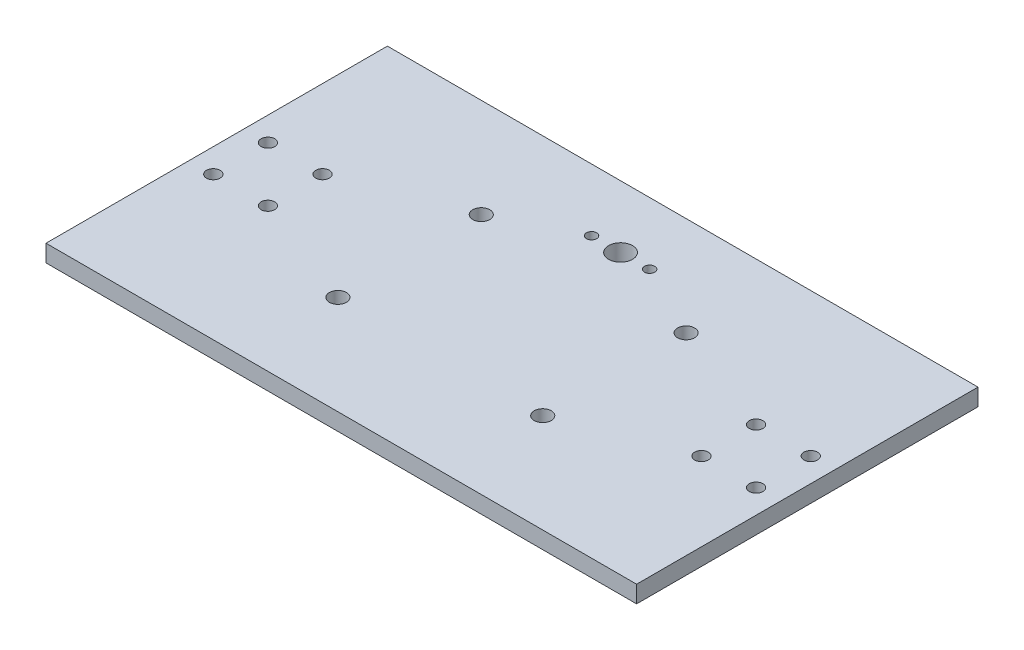
ISO-10303-21;
HEADER;
FILE_DESCRIPTION(('STEP AP214'),'2;1');
FILE_NAME('part.step','',(''),(''),'','','');
FILE_SCHEMA(('AUTOMOTIVE_DESIGN { 1 0 10303 214 1 1 1 1 }'));
ENDSEC;
DATA;
#1=APPLICATION_CONTEXT('core data for automotive mechanical design processes');
#2=APPLICATION_PROTOCOL_DEFINITION('international standard','automotive_design',2000,#1);
#3=PRODUCT_CONTEXT('',#1,'mechanical');
#4=PRODUCT('Part','Part','',(#3));
#5=PRODUCT_RELATED_PRODUCT_CATEGORY('part','',(#4));
#6=PRODUCT_DEFINITION_FORMATION('','',#4);
#7=PRODUCT_DEFINITION_CONTEXT('part definition',#1,'design');
#8=PRODUCT_DEFINITION('design','',#6,#7);
#9=PRODUCT_DEFINITION_SHAPE('','',#8);
#10=(LENGTH_UNIT() NAMED_UNIT(*) SI_UNIT(.MILLI.,.METRE.));
#11=(NAMED_UNIT(*) PLANE_ANGLE_UNIT() SI_UNIT($,.RADIAN.));
#12=(NAMED_UNIT(*) SI_UNIT($,.STERADIAN.) SOLID_ANGLE_UNIT());
#13=UNCERTAINTY_MEASURE_WITH_UNIT(LENGTH_MEASURE(1.E-05),#10,'distance_accuracy_value','');
#14=(GEOMETRIC_REPRESENTATION_CONTEXT(3) GLOBAL_UNCERTAINTY_ASSIGNED_CONTEXT((#13)) GLOBAL_UNIT_ASSIGNED_CONTEXT((#10,
#11,#12)) REPRESENTATION_CONTEXT('',''));
#15=CARTESIAN_POINT('',(0.,0.,0.));
#16=DIRECTION('',(0.,0.,1.));
#17=DIRECTION('',(1.,0.,0.));
#18=AXIS2_PLACEMENT_3D('',#15,#16,#17);
#19=CARTESIAN_POINT('',(0.,5.,0.));
#20=DIRECTION('',(0.,1.,0.));
#21=DIRECTION('',(0.,0.,1.));
#22=AXIS2_PLACEMENT_3D('',#19,#20,#21);
#23=PLANE('',#22);
#24=CARTESIAN_POINT('',(-79.5,5.,23.8));
#25=DIRECTION('',(0.,1.,0.));
#26=DIRECTION('',(0.,0.,-1.));
#27=AXIS2_PLACEMENT_3D('',#24,#25,#26);
#28=CIRCLE('',#27,2.);
#29=CARTESIAN_POINT('',(-79.5,5.,21.8));
#30=VERTEX_POINT('',#29);
#31=EDGE_CURVE('E187',#30,#30,#28,.T.);
#32=ORIENTED_EDGE('',*,*,#31,.F.);
#33=EDGE_LOOP('',(#32));
#34=FACE_BOUND('',#33,.T.);
#35=CARTESIAN_POINT('',(-63.5,5.,39.8));
#36=DIRECTION('',(0.,1.,0.));
#37=DIRECTION('',(0.,0.,-1.));
#38=AXIS2_PLACEMENT_3D('',#35,#36,#37);
#39=CIRCLE('',#38,2.);
#40=CARTESIAN_POINT('',(-63.5,5.,37.8));
#41=VERTEX_POINT('',#40);
#42=EDGE_CURVE('E175',#41,#41,#39,.T.);
#43=ORIENTED_EDGE('',*,*,#42,.F.);
#44=EDGE_LOOP('',(#43));
#45=FACE_BOUND('',#44,.T.);
#46=CARTESIAN_POINT('',(79.5,5.,39.8));
#47=DIRECTION('',(0.,1.,0.));
#48=DIRECTION('',(0.,0.,1.));
#49=AXIS2_PLACEMENT_3D('',#46,#47,#48);
#50=CIRCLE('',#49,2.);
#51=CARTESIAN_POINT('',(79.5,5.,41.8));
#52=VERTEX_POINT('',#51);
#53=EDGE_CURVE('E163',#52,#52,#50,.T.);
#54=ORIENTED_EDGE('',*,*,#53,.F.);
#55=EDGE_LOOP('',(#54));
#56=FACE_BOUND('',#55,.T.);
#57=CARTESIAN_POINT('',(63.5,5.,23.8));
#58=DIRECTION('',(0.,1.,0.));
#59=DIRECTION('',(0.,0.,1.));
#60=AXIS2_PLACEMENT_3D('',#57,#58,#59);
#61=CIRCLE('',#60,1.99999999999998);
#62=CARTESIAN_POINT('',(63.5,5.,25.8));
#63=VERTEX_POINT('',#62);
#64=EDGE_CURVE('E151',#63,#63,#61,.T.);
#65=ORIENTED_EDGE('',*,*,#64,.F.);
#66=EDGE_LOOP('',(#65));
#67=FACE_BOUND('',#66,.T.);
#68=CARTESIAN_POINT('',(30.,5.,52.7999999999999));
#69=DIRECTION('',(0.,1.,0.));
#70=DIRECTION('',(0.,0.,-1.));
#71=AXIS2_PLACEMENT_3D('',#68,#69,#70);
#72=CIRCLE('',#71,2.5);
#73=CARTESIAN_POINT('',(30.,5.,50.2999999999999));
#74=VERTEX_POINT('',#73);
#75=EDGE_CURVE('E139',#74,#74,#72,.T.);
#76=ORIENTED_EDGE('',*,*,#75,.F.);
#77=EDGE_LOOP('',(#76));
#78=FACE_BOUND('',#77,.T.);
#79=CARTESIAN_POINT('',(-30.,5.,10.8));
#80=DIRECTION('',(0.,1.,0.));
#81=DIRECTION('',(0.,0.,1.));
#82=AXIS2_PLACEMENT_3D('',#79,#80,#81);
#83=CIRCLE('',#82,2.49999999999999);
#84=CARTESIAN_POINT('',(-30.,5.,13.3));
#85=VERTEX_POINT('',#84);
#86=EDGE_CURVE('E127',#85,#85,#83,.T.);
#87=ORIENTED_EDGE('',*,*,#86,.F.);
#88=EDGE_LOOP('',(#87));
#89=FACE_BOUND('',#88,.T.);
#90=CARTESIAN_POINT('',(-8.5,5.,0.));
#91=DIRECTION('',(0.,1.,0.));
#92=DIRECTION('',(0.,0.,1.));
#93=AXIS2_PLACEMENT_3D('',#90,#91,#92);
#94=CIRCLE('',#93,1.5);
#95=CARTESIAN_POINT('',(-8.5,5.,1.5));
#96=VERTEX_POINT('',#95);
#97=EDGE_CURVE('E115',#96,#96,#94,.T.);
#98=ORIENTED_EDGE('',*,*,#97,.F.);
#99=EDGE_LOOP('',(#98));
#100=FACE_BOUND('',#99,.T.);
#101=DIRECTION('',(0.,0.,1.));
#102=VECTOR('',#101,1.);
#103=CARTESIAN_POINT('',(-86.5,5.,-18.2));
#104=LINE('',#103,#102);
#105=CARTESIAN_POINT('',(-86.5,5.,-18.2));
#106=VERTEX_POINT('',#105);
#107=CARTESIAN_POINT('',(-86.5,5.,81.8));
#108=VERTEX_POINT('',#107);
#109=EDGE_CURVE('E85',#106,#108,#104,.T.);
#110=ORIENTED_EDGE('',*,*,#109,.T.);
#111=DIRECTION('',(1.,0.,0.));
#112=VECTOR('',#111,1.);
#113=CARTESIAN_POINT('',(-86.5,5.,81.8));
#114=LINE('',#113,#112);
#115=CARTESIAN_POINT('',(86.5,5.,81.8));
#116=VERTEX_POINT('',#115);
#117=EDGE_CURVE('E80',#108,#116,#114,.T.);
#118=ORIENTED_EDGE('',*,*,#117,.T.);
#119=DIRECTION('',(0.,0.,-1.));
#120=VECTOR('',#119,1.);
#121=CARTESIAN_POINT('',(86.5,5.,-18.2));
#122=LINE('',#121,#120);
#123=CARTESIAN_POINT('',(86.5,5.,-18.2));
#124=VERTEX_POINT('',#123);
#125=EDGE_CURVE('E83',#116,#124,#122,.T.);
#126=ORIENTED_EDGE('',*,*,#125,.T.);
#127=DIRECTION('',(-1.,0.,0.));
#128=VECTOR('',#127,1.);
#129=CARTESIAN_POINT('',(-86.5,5.,-18.2));
#130=LINE('',#129,#128);
#131=EDGE_CURVE('E50',#124,#106,#130,.T.);
#132=ORIENTED_EDGE('',*,*,#131,.T.);
#133=EDGE_LOOP('',(#110,#118,#126,#132));
#134=FACE_BOUND('',#133,.T.);
#135=CARTESIAN_POINT('',(0.,5.,0.));
#136=DIRECTION('',(0.,1.,0.));
#137=DIRECTION('',(0.,0.,1.));
#138=AXIS2_PLACEMENT_3D('',#135,#136,#137);
#139=CIRCLE('',#138,3.5);
#140=CARTESIAN_POINT('',(0.,5.,3.5));
#141=VERTEX_POINT('',#140);
#142=EDGE_CURVE('E100',#141,#141,#139,.T.);
#143=ORIENTED_EDGE('',*,*,#142,.F.);
#144=EDGE_LOOP('',(#143));
#145=FACE_BOUND('',#144,.T.);
#146=CARTESIAN_POINT('',(8.5,5.,0.));
#147=DIRECTION('',(0.,1.,0.));
#148=DIRECTION('',(0.,0.,1.));
#149=AXIS2_PLACEMENT_3D('',#146,#147,#148);
#150=CIRCLE('',#149,1.5);
#151=CARTESIAN_POINT('',(8.5,5.,1.50000000000006));
#152=VERTEX_POINT('',#151);
#153=EDGE_CURVE('E121',#152,#152,#150,.T.);
#154=ORIENTED_EDGE('',*,*,#153,.F.);
#155=EDGE_LOOP('',(#154));
#156=FACE_BOUND('',#155,.T.);
#157=CARTESIAN_POINT('',(-30.0000000000001,5.,52.8));
#158=DIRECTION('',(0.,1.,0.));
#159=DIRECTION('',(0.,0.,1.));
#160=AXIS2_PLACEMENT_3D('',#157,#158,#159);
#161=CIRCLE('',#160,2.50000000000008);
#162=CARTESIAN_POINT('',(-30.0000000000001,5.,55.3000000000001));
#163=VERTEX_POINT('',#162);
#164=EDGE_CURVE('E133',#163,#163,#161,.T.);
#165=ORIENTED_EDGE('',*,*,#164,.F.);
#166=EDGE_LOOP('',(#165));
#167=FACE_BOUND('',#166,.T.);
#168=CARTESIAN_POINT('',(30.,5.,10.8));
#169=DIRECTION('',(0.,1.,0.));
#170=DIRECTION('',(0.,0.,-1.));
#171=AXIS2_PLACEMENT_3D('',#168,#169,#170);
#172=CIRCLE('',#171,2.5);
#173=CARTESIAN_POINT('',(30.,5.,8.29999999999997));
#174=VERTEX_POINT('',#173);
#175=EDGE_CURVE('E145',#174,#174,#172,.T.);
#176=ORIENTED_EDGE('',*,*,#175,.F.);
#177=EDGE_LOOP('',(#176));
#178=FACE_BOUND('',#177,.T.);
#179=CARTESIAN_POINT('',(79.5,5.,23.8));
#180=DIRECTION('',(0.,1.,0.));
#181=DIRECTION('',(0.,0.,1.));
#182=AXIS2_PLACEMENT_3D('',#179,#180,#181);
#183=CIRCLE('',#182,2.);
#184=CARTESIAN_POINT('',(79.5,5.,25.8));
#185=VERTEX_POINT('',#184);
#186=EDGE_CURVE('E157',#185,#185,#183,.T.);
#187=ORIENTED_EDGE('',*,*,#186,.F.);
#188=EDGE_LOOP('',(#187));
#189=FACE_BOUND('',#188,.T.);
#190=CARTESIAN_POINT('',(63.5,5.,39.8));
#191=DIRECTION('',(0.,1.,0.));
#192=DIRECTION('',(0.,0.,1.));
#193=AXIS2_PLACEMENT_3D('',#190,#191,#192);
#194=CIRCLE('',#193,2.);
#195=CARTESIAN_POINT('',(63.5,5.,41.8));
#196=VERTEX_POINT('',#195);
#197=EDGE_CURVE('E169',#196,#196,#194,.T.);
#198=ORIENTED_EDGE('',*,*,#197,.F.);
#199=EDGE_LOOP('',(#198));
#200=FACE_BOUND('',#199,.T.);
#201=CARTESIAN_POINT('',(-79.5,5.,39.8));
#202=DIRECTION('',(0.,1.,0.));
#203=DIRECTION('',(0.,0.,-1.));
#204=AXIS2_PLACEMENT_3D('',#201,#202,#203);
#205=CIRCLE('',#204,2.);
#206=CARTESIAN_POINT('',(-79.5,5.,37.8));
#207=VERTEX_POINT('',#206);
#208=EDGE_CURVE('E181',#207,#207,#205,.T.);
#209=ORIENTED_EDGE('',*,*,#208,.F.);
#210=EDGE_LOOP('',(#209));
#211=FACE_BOUND('',#210,.T.);
#212=CARTESIAN_POINT('',(-63.5,5.,23.8));
#213=DIRECTION('',(0.,1.,0.));
#214=DIRECTION('',(0.,0.,-1.));
#215=AXIS2_PLACEMENT_3D('',#212,#213,#214);
#216=CIRCLE('',#215,1.99999999999998);
#217=CARTESIAN_POINT('',(-63.5,5.,21.8));
#218=VERTEX_POINT('',#217);
#219=EDGE_CURVE('E193',#218,#218,#216,.T.);
#220=ORIENTED_EDGE('',*,*,#219,.F.);
#221=EDGE_LOOP('',(#220));
#222=FACE_BOUND('',#221,.T.);
#223=ADVANCED_FACE('F33',(#34,#45,#56,#67,#78,#89,#100,#134,#145,#156,#167,#178,#189,#200,#211,
#222),#23,.T.);
#224=CARTESIAN_POINT('',(0.,0.,0.));
#225=DIRECTION('',(0.,1.,0.));
#226=DIRECTION('',(0.,0.,1.));
#227=AXIS2_PLACEMENT_3D('',#224,#225,#226);
#228=PLANE('',#227);
#229=DIRECTION('',(0.,0.,1.));
#230=VECTOR('',#229,1.);
#231=CARTESIAN_POINT('',(-86.5,0.,-18.2));
#232=LINE('',#231,#230);
#233=CARTESIAN_POINT('',(-86.5,0.,-18.2));
#234=VERTEX_POINT('',#233);
#235=CARTESIAN_POINT('',(-86.5,0.,81.8));
#236=VERTEX_POINT('',#235);
#237=EDGE_CURVE('E97',#234,#236,#232,.T.);
#238=ORIENTED_EDGE('',*,*,#237,.F.);
#239=DIRECTION('',(-1.,0.,0.));
#240=VECTOR('',#239,1.);
#241=CARTESIAN_POINT('',(-86.5,0.,-18.2));
#242=LINE('',#241,#240);
#243=CARTESIAN_POINT('',(86.5,0.,-18.2));
#244=VERTEX_POINT('',#243);
#245=EDGE_CURVE('E73',#244,#234,#242,.T.);
#246=ORIENTED_EDGE('',*,*,#245,.F.);
#247=DIRECTION('',(0.,0.,-1.));
#248=VECTOR('',#247,1.);
#249=CARTESIAN_POINT('',(86.5,0.,-18.2));
#250=LINE('',#249,#248);
#251=CARTESIAN_POINT('',(86.5,0.,81.8));
#252=VERTEX_POINT('',#251);
#253=EDGE_CURVE('E67',#252,#244,#250,.T.);
#254=ORIENTED_EDGE('',*,*,#253,.F.);
#255=DIRECTION('',(1.,0.,0.));
#256=VECTOR('',#255,1.);
#257=CARTESIAN_POINT('',(-86.5,0.,81.8));
#258=LINE('',#257,#256);
#259=EDGE_CURVE('E89',#236,#252,#258,.T.);
#260=ORIENTED_EDGE('',*,*,#259,.F.);
#261=EDGE_LOOP('',(#238,#246,#254,#260));
#262=FACE_BOUND('',#261,.T.);
#263=CARTESIAN_POINT('',(0.,0.,0.));
#264=DIRECTION('',(0.,1.,0.));
#265=DIRECTION('',(0.,0.,1.));
#266=AXIS2_PLACEMENT_3D('',#263,#264,#265);
#267=CIRCLE('',#266,3.5);
#268=CARTESIAN_POINT('',(0.,0.,3.5));
#269=VERTEX_POINT('',#268);
#270=EDGE_CURVE('E112',#269,#269,#267,.T.);
#271=ORIENTED_EDGE('',*,*,#270,.T.);
#272=EDGE_LOOP('',(#271));
#273=FACE_BOUND('',#272,.T.);
#274=CARTESIAN_POINT('',(-8.5,0.,0.));
#275=DIRECTION('',(0.,1.,0.));
#276=DIRECTION('',(0.,0.,1.));
#277=AXIS2_PLACEMENT_3D('',#274,#275,#276);
#278=CIRCLE('',#277,1.5);
#279=CARTESIAN_POINT('',(-8.5,0.,1.5));
#280=VERTEX_POINT('',#279);
#281=EDGE_CURVE('E118',#280,#280,#278,.T.);
#282=ORIENTED_EDGE('',*,*,#281,.T.);
#283=EDGE_LOOP('',(#282));
#284=FACE_BOUND('',#283,.T.);
#285=CARTESIAN_POINT('',(8.5,0.,0.));
#286=DIRECTION('',(0.,1.,0.));
#287=DIRECTION('',(0.,0.,1.));
#288=AXIS2_PLACEMENT_3D('',#285,#286,#287);
#289=CIRCLE('',#288,1.5);
#290=CARTESIAN_POINT('',(8.5,0.,1.50000000000006));
#291=VERTEX_POINT('',#290);
#292=EDGE_CURVE('E124',#291,#291,#289,.T.);
#293=ORIENTED_EDGE('',*,*,#292,.T.);
#294=EDGE_LOOP('',(#293));
#295=FACE_BOUND('',#294,.T.);
#296=CARTESIAN_POINT('',(-30.,0.,10.8));
#297=DIRECTION('',(0.,1.,0.));
#298=DIRECTION('',(0.,0.,1.));
#299=AXIS2_PLACEMENT_3D('',#296,#297,#298);
#300=CIRCLE('',#299,2.49999999999999);
#301=CARTESIAN_POINT('',(-30.,0.,13.3));
#302=VERTEX_POINT('',#301);
#303=EDGE_CURVE('E130',#302,#302,#300,.T.);
#304=ORIENTED_EDGE('',*,*,#303,.T.);
#305=EDGE_LOOP('',(#304));
#306=FACE_BOUND('',#305,.T.);
#307=CARTESIAN_POINT('',(-30.0000000000001,0.,52.8));
#308=DIRECTION('',(0.,1.,0.));
#309=DIRECTION('',(0.,0.,1.));
#310=AXIS2_PLACEMENT_3D('',#307,#308,#309);
#311=CIRCLE('',#310,2.50000000000008);
#312=CARTESIAN_POINT('',(-30.0000000000001,0.,55.3000000000001));
#313=VERTEX_POINT('',#312);
#314=EDGE_CURVE('E136',#313,#313,#311,.T.);
#315=ORIENTED_EDGE('',*,*,#314,.T.);
#316=EDGE_LOOP('',(#315));
#317=FACE_BOUND('',#316,.T.);
#318=CARTESIAN_POINT('',(30.,0.,52.7999999999999));
#319=DIRECTION('',(0.,1.,0.));
#320=DIRECTION('',(0.,0.,-1.));
#321=AXIS2_PLACEMENT_3D('',#318,#319,#320);
#322=CIRCLE('',#321,2.5);
#323=CARTESIAN_POINT('',(30.,0.,50.2999999999999));
#324=VERTEX_POINT('',#323);
#325=EDGE_CURVE('E142',#324,#324,#322,.T.);
#326=ORIENTED_EDGE('',*,*,#325,.T.);
#327=EDGE_LOOP('',(#326));
#328=FACE_BOUND('',#327,.T.);
#329=CARTESIAN_POINT('',(30.,0.,10.8));
#330=DIRECTION('',(0.,1.,0.));
#331=DIRECTION('',(0.,0.,-1.));
#332=AXIS2_PLACEMENT_3D('',#329,#330,#331);
#333=CIRCLE('',#332,2.5);
#334=CARTESIAN_POINT('',(30.,0.,8.29999999999997));
#335=VERTEX_POINT('',#334);
#336=EDGE_CURVE('E148',#335,#335,#333,.T.);
#337=ORIENTED_EDGE('',*,*,#336,.T.);
#338=EDGE_LOOP('',(#337));
#339=FACE_BOUND('',#338,.T.);
#340=CARTESIAN_POINT('',(63.5,0.,23.8));
#341=DIRECTION('',(0.,1.,0.));
#342=DIRECTION('',(0.,0.,1.));
#343=AXIS2_PLACEMENT_3D('',#340,#341,#342);
#344=CIRCLE('',#343,1.99999999999998);
#345=CARTESIAN_POINT('',(63.5,0.,25.8));
#346=VERTEX_POINT('',#345);
#347=EDGE_CURVE('E154',#346,#346,#344,.T.);
#348=ORIENTED_EDGE('',*,*,#347,.T.);
#349=EDGE_LOOP('',(#348));
#350=FACE_BOUND('',#349,.T.);
#351=CARTESIAN_POINT('',(79.5,0.,23.8));
#352=DIRECTION('',(0.,1.,0.));
#353=DIRECTION('',(0.,0.,1.));
#354=AXIS2_PLACEMENT_3D('',#351,#352,#353);
#355=CIRCLE('',#354,2.);
#356=CARTESIAN_POINT('',(79.5,0.,25.8));
#357=VERTEX_POINT('',#356);
#358=EDGE_CURVE('E160',#357,#357,#355,.T.);
#359=ORIENTED_EDGE('',*,*,#358,.T.);
#360=EDGE_LOOP('',(#359));
#361=FACE_BOUND('',#360,.T.);
#362=CARTESIAN_POINT('',(79.5,0.,39.8));
#363=DIRECTION('',(0.,1.,0.));
#364=DIRECTION('',(0.,0.,1.));
#365=AXIS2_PLACEMENT_3D('',#362,#363,#364);
#366=CIRCLE('',#365,2.);
#367=CARTESIAN_POINT('',(79.5,0.,41.8));
#368=VERTEX_POINT('',#367);
#369=EDGE_CURVE('E166',#368,#368,#366,.T.);
#370=ORIENTED_EDGE('',*,*,#369,.T.);
#371=EDGE_LOOP('',(#370));
#372=FACE_BOUND('',#371,.T.);
#373=CARTESIAN_POINT('',(63.5,0.,39.8));
#374=DIRECTION('',(0.,1.,0.));
#375=DIRECTION('',(0.,0.,1.));
#376=AXIS2_PLACEMENT_3D('',#373,#374,#375);
#377=CIRCLE('',#376,2.);
#378=CARTESIAN_POINT('',(63.5,0.,41.8));
#379=VERTEX_POINT('',#378);
#380=EDGE_CURVE('E172',#379,#379,#377,.T.);
#381=ORIENTED_EDGE('',*,*,#380,.T.);
#382=EDGE_LOOP('',(#381));
#383=FACE_BOUND('',#382,.T.);
#384=CARTESIAN_POINT('',(-63.5,0.,39.8));
#385=DIRECTION('',(0.,1.,0.));
#386=DIRECTION('',(0.,0.,-1.));
#387=AXIS2_PLACEMENT_3D('',#384,#385,#386);
#388=CIRCLE('',#387,2.);
#389=CARTESIAN_POINT('',(-63.5,0.,37.8));
#390=VERTEX_POINT('',#389);
#391=EDGE_CURVE('E178',#390,#390,#388,.T.);
#392=ORIENTED_EDGE('',*,*,#391,.T.);
#393=EDGE_LOOP('',(#392));
#394=FACE_BOUND('',#393,.T.);
#395=CARTESIAN_POINT('',(-79.5,0.,39.8));
#396=DIRECTION('',(0.,1.,0.));
#397=DIRECTION('',(0.,0.,-1.));
#398=AXIS2_PLACEMENT_3D('',#395,#396,#397);
#399=CIRCLE('',#398,2.);
#400=CARTESIAN_POINT('',(-79.5,0.,37.8));
#401=VERTEX_POINT('',#400);
#402=EDGE_CURVE('E184',#401,#401,#399,.T.);
#403=ORIENTED_EDGE('',*,*,#402,.T.);
#404=EDGE_LOOP('',(#403));
#405=FACE_BOUND('',#404,.T.);
#406=CARTESIAN_POINT('',(-79.5,0.,23.8));
#407=DIRECTION('',(0.,1.,0.));
#408=DIRECTION('',(0.,0.,-1.));
#409=AXIS2_PLACEMENT_3D('',#406,#407,#408);
#410=CIRCLE('',#409,2.);
#411=CARTESIAN_POINT('',(-79.5,0.,21.8));
#412=VERTEX_POINT('',#411);
#413=EDGE_CURVE('E190',#412,#412,#410,.T.);
#414=ORIENTED_EDGE('',*,*,#413,.T.);
#415=EDGE_LOOP('',(#414));
#416=FACE_BOUND('',#415,.T.);
#417=CARTESIAN_POINT('',(-63.5,0.,23.8));
#418=DIRECTION('',(0.,1.,0.));
#419=DIRECTION('',(0.,0.,-1.));
#420=AXIS2_PLACEMENT_3D('',#417,#418,#419);
#421=CIRCLE('',#420,1.99999999999998);
#422=CARTESIAN_POINT('',(-63.5,0.,21.8));
#423=VERTEX_POINT('',#422);
#424=EDGE_CURVE('E196',#423,#423,#421,.T.);
#425=ORIENTED_EDGE('',*,*,#424,.T.);
#426=EDGE_LOOP('',(#425));
#427=FACE_BOUND('',#426,.T.);
#428=ADVANCED_FACE('F108',(#262,#273,#284,#295,#306,#317,#328,#339,#350,#361,#372,#383,#394,
#405,#416,#427),#228,.F.);
#429=CARTESIAN_POINT('',(-86.5,5.,-18.2));
#430=DIRECTION('',(1.,0.,0.));
#431=DIRECTION('',(0.,0.,-1.));
#432=AXIS2_PLACEMENT_3D('',#429,#430,#431);
#433=PLANE('',#432);
#434=ORIENTED_EDGE('',*,*,#237,.T.);
#435=DIRECTION('',(0.,-1.,0.));
#436=VECTOR('',#435,1.);
#437=CARTESIAN_POINT('',(-86.5,5.,81.8));
#438=LINE('',#437,#436);
#439=EDGE_CURVE('E11',#108,#236,#438,.T.);
#440=ORIENTED_EDGE('',*,*,#439,.F.);
#441=ORIENTED_EDGE('',*,*,#109,.F.);
#442=DIRECTION('',(0.,-1.,0.));
#443=VECTOR('',#442,1.);
#444=CARTESIAN_POINT('',(-86.5,5.,-18.2));
#445=LINE('',#444,#443);
#446=EDGE_CURVE('E93',#106,#234,#445,.T.);
#447=ORIENTED_EDGE('',*,*,#446,.T.);
#448=EDGE_LOOP('',(#434,#440,#441,#447));
#449=FACE_BOUND('',#448,.T.);
#450=ADVANCED_FACE('F35',(#449),#433,.F.);
#451=CARTESIAN_POINT('',(-86.5,5.,81.8));
#452=DIRECTION('',(0.,0.,-1.));
#453=DIRECTION('',(-1.,0.,0.));
#454=AXIS2_PLACEMENT_3D('',#451,#452,#453);
#455=PLANE('',#454);
#456=ORIENTED_EDGE('',*,*,#259,.T.);
#457=DIRECTION('',(0.,-1.,0.));
#458=VECTOR('',#457,1.);
#459=CARTESIAN_POINT('',(86.5,5.,81.8));
#460=LINE('',#459,#458);
#461=EDGE_CURVE('E42',#116,#252,#460,.T.);
#462=ORIENTED_EDGE('',*,*,#461,.F.);
#463=ORIENTED_EDGE('',*,*,#117,.F.);
#464=ORIENTED_EDGE('',*,*,#439,.T.);
#465=EDGE_LOOP('',(#456,#462,#463,#464));
#466=FACE_BOUND('',#465,.T.);
#467=ADVANCED_FACE('F88',(#466),#455,.F.);
#468=CARTESIAN_POINT('',(86.5,5.,-18.2));
#469=DIRECTION('',(-1.,0.,0.));
#470=DIRECTION('',(0.,0.,1.));
#471=AXIS2_PLACEMENT_3D('',#468,#469,#470);
#472=PLANE('',#471);
#473=ORIENTED_EDGE('',*,*,#253,.T.);
#474=DIRECTION('',(0.,-1.,0.));
#475=VECTOR('',#474,1.);
#476=CARTESIAN_POINT('',(86.5,5.,-18.2));
#477=LINE('',#476,#475);
#478=EDGE_CURVE('E90',#124,#244,#477,.T.);
#479=ORIENTED_EDGE('',*,*,#478,.F.);
#480=ORIENTED_EDGE('',*,*,#125,.F.);
#481=ORIENTED_EDGE('',*,*,#461,.T.);
#482=EDGE_LOOP('',(#473,#479,#480,#481));
#483=FACE_BOUND('',#482,.T.);
#484=ADVANCED_FACE('F91',(#483),#472,.F.);
#485=CARTESIAN_POINT('',(-86.5,5.,-18.2));
#486=DIRECTION('',(0.,0.,1.));
#487=DIRECTION('',(1.,0.,0.));
#488=AXIS2_PLACEMENT_3D('',#485,#486,#487);
#489=PLANE('',#488);
#490=ORIENTED_EDGE('',*,*,#245,.T.);
#491=ORIENTED_EDGE('',*,*,#446,.F.);
#492=ORIENTED_EDGE('',*,*,#131,.F.);
#493=ORIENTED_EDGE('',*,*,#478,.T.);
#494=EDGE_LOOP('',(#490,#491,#492,#493));
#495=FACE_BOUND('',#494,.T.);
#496=ADVANCED_FACE('F105',(#495),#489,.F.);
#497=CARTESIAN_POINT('',(0.,5.,0.));
#498=DIRECTION('',(0.,-1.,0.));
#499=DIRECTION('',(0.,0.,-1.));
#500=AXIS2_PLACEMENT_3D('',#497,#498,#499);
#501=CYLINDRICAL_SURFACE('',#500,3.5);
#502=ORIENTED_EDGE('',*,*,#142,.T.);
#503=EDGE_LOOP('',(#502));
#504=FACE_BOUND('',#503,.T.);
#505=ORIENTED_EDGE('',*,*,#270,.F.);
#506=EDGE_LOOP('',(#505));
#507=FACE_BOUND('',#506,.T.);
#508=ADVANCED_FACE('F215',(#504,#507),#501,.F.);
#509=CARTESIAN_POINT('',(-8.5,5.,0.));
#510=DIRECTION('',(0.,-1.,0.));
#511=DIRECTION('',(0.,0.,-1.));
#512=AXIS2_PLACEMENT_3D('',#509,#510,#511);
#513=CYLINDRICAL_SURFACE('',#512,1.5);
#514=ORIENTED_EDGE('',*,*,#97,.T.);
#515=EDGE_LOOP('',(#514));
#516=FACE_BOUND('',#515,.T.);
#517=ORIENTED_EDGE('',*,*,#281,.F.);
#518=EDGE_LOOP('',(#517));
#519=FACE_BOUND('',#518,.T.);
#520=ADVANCED_FACE('F261',(#516,#519),#513,.F.);
#521=CARTESIAN_POINT('',(8.5,5.,0.));
#522=DIRECTION('',(0.,-1.,0.));
#523=DIRECTION('',(0.,0.,-1.));
#524=AXIS2_PLACEMENT_3D('',#521,#522,#523);
#525=CYLINDRICAL_SURFACE('',#524,1.5);
#526=ORIENTED_EDGE('',*,*,#153,.T.);
#527=EDGE_LOOP('',(#526));
#528=FACE_BOUND('',#527,.T.);
#529=ORIENTED_EDGE('',*,*,#292,.F.);
#530=EDGE_LOOP('',(#529));
#531=FACE_BOUND('',#530,.T.);
#532=ADVANCED_FACE('F269',(#528,#531),#525,.F.);
#533=CARTESIAN_POINT('',(-30.,5.,10.8));
#534=DIRECTION('',(0.,-1.,0.));
#535=DIRECTION('',(0.,0.,-1.));
#536=AXIS2_PLACEMENT_3D('',#533,#534,#535);
#537=CYLINDRICAL_SURFACE('',#536,2.49999999999999);
#538=ORIENTED_EDGE('',*,*,#86,.T.);
#539=EDGE_LOOP('',(#538));
#540=FACE_BOUND('',#539,.T.);
#541=ORIENTED_EDGE('',*,*,#303,.F.);
#542=EDGE_LOOP('',(#541));
#543=FACE_BOUND('',#542,.T.);
#544=ADVANCED_FACE('F277',(#540,#543),#537,.F.);
#545=CARTESIAN_POINT('',(-30.0000000000001,5.,52.8));
#546=DIRECTION('',(0.,-1.,0.));
#547=DIRECTION('',(0.,0.,-1.));
#548=AXIS2_PLACEMENT_3D('',#545,#546,#547);
#549=CYLINDRICAL_SURFACE('',#548,2.50000000000008);
#550=ORIENTED_EDGE('',*,*,#164,.T.);
#551=EDGE_LOOP('',(#550));
#552=FACE_BOUND('',#551,.T.);
#553=ORIENTED_EDGE('',*,*,#314,.F.);
#554=EDGE_LOOP('',(#553));
#555=FACE_BOUND('',#554,.T.);
#556=ADVANCED_FACE('F286',(#552,#555),#549,.F.);
#557=CARTESIAN_POINT('',(30.,5.,52.7999999999999));
#558=DIRECTION('',(0.,-1.,0.));
#559=DIRECTION('',(0.,0.,-1.));
#560=AXIS2_PLACEMENT_3D('',#557,#558,#559);
#561=CYLINDRICAL_SURFACE('',#560,2.5);
#562=ORIENTED_EDGE('',*,*,#75,.T.);
#563=EDGE_LOOP('',(#562));
#564=FACE_BOUND('',#563,.T.);
#565=ORIENTED_EDGE('',*,*,#325,.F.);
#566=EDGE_LOOP('',(#565));
#567=FACE_BOUND('',#566,.T.);
#568=ADVANCED_FACE('F295',(#564,#567),#561,.F.);
#569=CARTESIAN_POINT('',(30.,5.,10.8));
#570=DIRECTION('',(0.,-1.,0.));
#571=DIRECTION('',(0.,0.,-1.));
#572=AXIS2_PLACEMENT_3D('',#569,#570,#571);
#573=CYLINDRICAL_SURFACE('',#572,2.5);
#574=ORIENTED_EDGE('',*,*,#175,.T.);
#575=EDGE_LOOP('',(#574));
#576=FACE_BOUND('',#575,.T.);
#577=ORIENTED_EDGE('',*,*,#336,.F.);
#578=EDGE_LOOP('',(#577));
#579=FACE_BOUND('',#578,.T.);
#580=ADVANCED_FACE('F304',(#576,#579),#573,.F.);
#581=CARTESIAN_POINT('',(63.5,5.,23.8));
#582=DIRECTION('',(0.,-1.,0.));
#583=DIRECTION('',(0.,0.,-1.));
#584=AXIS2_PLACEMENT_3D('',#581,#582,#583);
#585=CYLINDRICAL_SURFACE('',#584,1.99999999999998);
#586=ORIENTED_EDGE('',*,*,#64,.T.);
#587=EDGE_LOOP('',(#586));
#588=FACE_BOUND('',#587,.T.);
#589=ORIENTED_EDGE('',*,*,#347,.F.);
#590=EDGE_LOOP('',(#589));
#591=FACE_BOUND('',#590,.T.);
#592=ADVANCED_FACE('F313',(#588,#591),#585,.F.);
#593=CARTESIAN_POINT('',(79.5,5.,23.8));
#594=DIRECTION('',(0.,-1.,0.));
#595=DIRECTION('',(0.,0.,-1.));
#596=AXIS2_PLACEMENT_3D('',#593,#594,#595);
#597=CYLINDRICAL_SURFACE('',#596,2.);
#598=ORIENTED_EDGE('',*,*,#186,.T.);
#599=EDGE_LOOP('',(#598));
#600=FACE_BOUND('',#599,.T.);
#601=ORIENTED_EDGE('',*,*,#358,.F.);
#602=EDGE_LOOP('',(#601));
#603=FACE_BOUND('',#602,.T.);
#604=ADVANCED_FACE('F322',(#600,#603),#597,.F.);
#605=CARTESIAN_POINT('',(79.5,5.,39.8));
#606=DIRECTION('',(0.,-1.,0.));
#607=DIRECTION('',(0.,0.,-1.));
#608=AXIS2_PLACEMENT_3D('',#605,#606,#607);
#609=CYLINDRICAL_SURFACE('',#608,2.);
#610=ORIENTED_EDGE('',*,*,#53,.T.);
#611=EDGE_LOOP('',(#610));
#612=FACE_BOUND('',#611,.T.);
#613=ORIENTED_EDGE('',*,*,#369,.F.);
#614=EDGE_LOOP('',(#613));
#615=FACE_BOUND('',#614,.T.);
#616=ADVANCED_FACE('F331',(#612,#615),#609,.F.);
#617=CARTESIAN_POINT('',(63.5,5.,39.8));
#618=DIRECTION('',(0.,-1.,0.));
#619=DIRECTION('',(0.,0.,-1.));
#620=AXIS2_PLACEMENT_3D('',#617,#618,#619);
#621=CYLINDRICAL_SURFACE('',#620,2.);
#622=ORIENTED_EDGE('',*,*,#197,.T.);
#623=EDGE_LOOP('',(#622));
#624=FACE_BOUND('',#623,.T.);
#625=ORIENTED_EDGE('',*,*,#380,.F.);
#626=EDGE_LOOP('',(#625));
#627=FACE_BOUND('',#626,.T.);
#628=ADVANCED_FACE('F340',(#624,#627),#621,.F.);
#629=CARTESIAN_POINT('',(-63.5,5.,39.8));
#630=DIRECTION('',(0.,-1.,0.));
#631=DIRECTION('',(0.,0.,-1.));
#632=AXIS2_PLACEMENT_3D('',#629,#630,#631);
#633=CYLINDRICAL_SURFACE('',#632,2.);
#634=ORIENTED_EDGE('',*,*,#42,.T.);
#635=EDGE_LOOP('',(#634));
#636=FACE_BOUND('',#635,.T.);
#637=ORIENTED_EDGE('',*,*,#391,.F.);
#638=EDGE_LOOP('',(#637));
#639=FACE_BOUND('',#638,.T.);
#640=ADVANCED_FACE('F349',(#636,#639),#633,.F.);
#641=CARTESIAN_POINT('',(-79.5,5.,39.8));
#642=DIRECTION('',(0.,-1.,0.));
#643=DIRECTION('',(0.,0.,-1.));
#644=AXIS2_PLACEMENT_3D('',#641,#642,#643);
#645=CYLINDRICAL_SURFACE('',#644,2.);
#646=ORIENTED_EDGE('',*,*,#208,.T.);
#647=EDGE_LOOP('',(#646));
#648=FACE_BOUND('',#647,.T.);
#649=ORIENTED_EDGE('',*,*,#402,.F.);
#650=EDGE_LOOP('',(#649));
#651=FACE_BOUND('',#650,.T.);
#652=ADVANCED_FACE('F358',(#648,#651),#645,.F.);
#653=CARTESIAN_POINT('',(-79.5,5.,23.8));
#654=DIRECTION('',(0.,-1.,0.));
#655=DIRECTION('',(0.,0.,-1.));
#656=AXIS2_PLACEMENT_3D('',#653,#654,#655);
#657=CYLINDRICAL_SURFACE('',#656,2.);
#658=ORIENTED_EDGE('',*,*,#31,.T.);
#659=EDGE_LOOP('',(#658));
#660=FACE_BOUND('',#659,.T.);
#661=ORIENTED_EDGE('',*,*,#413,.F.);
#662=EDGE_LOOP('',(#661));
#663=FACE_BOUND('',#662,.T.);
#664=ADVANCED_FACE('F367',(#660,#663),#657,.F.);
#665=CARTESIAN_POINT('',(-63.5,5.,23.8));
#666=DIRECTION('',(0.,-1.,0.));
#667=DIRECTION('',(0.,0.,-1.));
#668=AXIS2_PLACEMENT_3D('',#665,#666,#667);
#669=CYLINDRICAL_SURFACE('',#668,1.99999999999998);
#670=ORIENTED_EDGE('',*,*,#219,.T.);
#671=EDGE_LOOP('',(#670));
#672=FACE_BOUND('',#671,.T.);
#673=ORIENTED_EDGE('',*,*,#424,.F.);
#674=EDGE_LOOP('',(#673));
#675=FACE_BOUND('',#674,.T.);
#676=ADVANCED_FACE('F202',(#672,#675),#669,.F.);
#677=CLOSED_SHELL('',(#223,#428,#450,#467,#484,#496,#508,#520,#532,#544,#556,#568,#580,#592,
#604,#616,#628,#640,#652,#664,#676));
#678=MANIFOLD_SOLID_BREP('B2',#677);
#679=ADVANCED_BREP_SHAPE_REPRESENTATION('',(#18,#678),#14);
#680=SHAPE_DEFINITION_REPRESENTATION(#9,#679);
ENDSEC;
END-ISO-10303-21;
